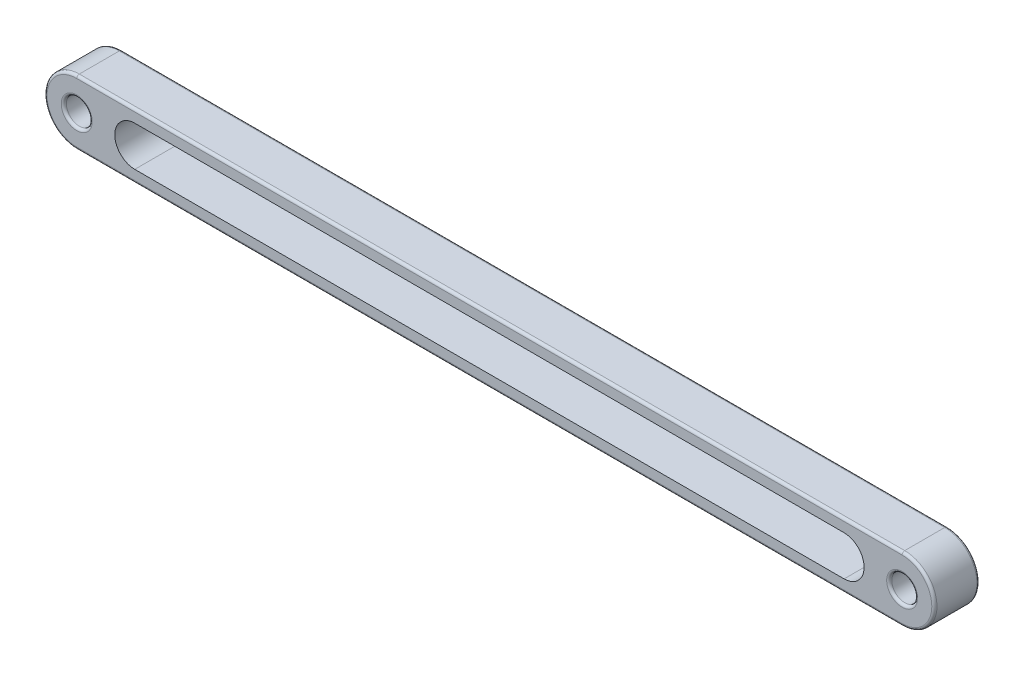
ISO-10303-21;
HEADER;
FILE_DESCRIPTION(('STEP AP214'),'2;1');
FILE_NAME('part.step','',(''),(''),'','','');
FILE_SCHEMA(('AUTOMOTIVE_DESIGN { 1 0 10303 214 1 1 1 1 }'));
ENDSEC;
DATA;
#1=APPLICATION_CONTEXT('core data for automotive mechanical design processes');
#2=APPLICATION_PROTOCOL_DEFINITION('international standard','automotive_design',2000,#1);
#3=PRODUCT_CONTEXT('',#1,'mechanical');
#4=PRODUCT('Part','Part','',(#3));
#5=PRODUCT_RELATED_PRODUCT_CATEGORY('part','',(#4));
#6=PRODUCT_DEFINITION_FORMATION('','',#4);
#7=PRODUCT_DEFINITION_CONTEXT('part definition',#1,'design');
#8=PRODUCT_DEFINITION('design','',#6,#7);
#9=PRODUCT_DEFINITION_SHAPE('','',#8);
#10=(LENGTH_UNIT() NAMED_UNIT(*) SI_UNIT(.MILLI.,.METRE.));
#11=(NAMED_UNIT(*) PLANE_ANGLE_UNIT() SI_UNIT($,.RADIAN.));
#12=(NAMED_UNIT(*) SI_UNIT($,.STERADIAN.) SOLID_ANGLE_UNIT());
#13=UNCERTAINTY_MEASURE_WITH_UNIT(LENGTH_MEASURE(1.E-05),#10,'distance_accuracy_value','');
#14=(GEOMETRIC_REPRESENTATION_CONTEXT(3) GLOBAL_UNCERTAINTY_ASSIGNED_CONTEXT((#13)) GLOBAL_UNIT_ASSIGNED_CONTEXT((#10,
#11,#12)) REPRESENTATION_CONTEXT('',''));
#15=CARTESIAN_POINT('',(0.,0.,0.));
#16=DIRECTION('',(0.,0.,1.));
#17=DIRECTION('',(1.,0.,0.));
#18=AXIS2_PLACEMENT_3D('',#15,#16,#17);
#19=CARTESIAN_POINT('',(-320.,0.,17.5));
#20=DIRECTION('',(0.,0.,-1.));
#21=DIRECTION('',(-1.,0.,0.));
#22=AXIS2_PLACEMENT_3D('',#19,#20,#21);
#23=CYLINDRICAL_SURFACE('',#22,25.);
#24=DIRECTION('',(0.,0.,-1.));
#25=VECTOR('',#24,1.);
#26=CARTESIAN_POINT('',(-320.,-25.,17.5));
#27=LINE('',#26,#25);
#28=CARTESIAN_POINT('',(-320.,-25.,15.5));
#29=VERTEX_POINT('',#28);
#30=CARTESIAN_POINT('',(-320.,-25.,-15.5));
#31=VERTEX_POINT('',#30);
#32=EDGE_CURVE('E177',#29,#31,#27,.T.);
#33=ORIENTED_EDGE('',*,*,#32,.F.);
#34=CARTESIAN_POINT('',(-320.,0.,15.5));
#35=DIRECTION('',(0.,0.,1.));
#36=DIRECTION('',(1.,0.,0.));
#37=AXIS2_PLACEMENT_3D('',#34,#35,#36);
#38=CIRCLE('',#37,25.);
#39=CARTESIAN_POINT('',(-320.,25.,15.5));
#40=VERTEX_POINT('',#39);
#41=EDGE_CURVE('E207',#29,#40,#38,.F.);
#42=ORIENTED_EDGE('',*,*,#41,.T.);
#43=DIRECTION('',(0.,0.,-1.));
#44=VECTOR('',#43,1.);
#45=CARTESIAN_POINT('',(-320.,25.,17.5));
#46=LINE('',#45,#44);
#47=CARTESIAN_POINT('',(-320.,25.,-15.5));
#48=VERTEX_POINT('',#47);
#49=EDGE_CURVE('E168',#40,#48,#46,.T.);
#50=ORIENTED_EDGE('',*,*,#49,.T.);
#51=CARTESIAN_POINT('',(-320.,0.,-15.5));
#52=DIRECTION('',(0.,0.,1.));
#53=DIRECTION('',(1.,0.,0.));
#54=AXIS2_PLACEMENT_3D('',#51,#52,#53);
#55=CIRCLE('',#54,25.);
#56=EDGE_CURVE('E205',#48,#31,#55,.T.);
#57=ORIENTED_EDGE('',*,*,#56,.T.);
#58=EDGE_LOOP('',(#33,#42,#50,#57));
#59=FACE_BOUND('',#58,.T.);
#60=ADVANCED_FACE('F34',(#59),#23,.T.);
#61=CARTESIAN_POINT('',(-320.,-25.,17.5));
#62=DIRECTION('',(0.,1.,0.));
#63=DIRECTION('',(0.,0.,1.));
#64=AXIS2_PLACEMENT_3D('',#61,#62,#63);
#65=PLANE('',#64);
#66=DIRECTION('',(0.,0.,-1.));
#67=VECTOR('',#66,1.);
#68=CARTESIAN_POINT('',(320.,-25.,17.5));
#69=LINE('',#68,#67);
#70=CARTESIAN_POINT('',(320.,-25.,15.5));
#71=VERTEX_POINT('',#70);
#72=CARTESIAN_POINT('',(320.,-25.,-15.5));
#73=VERTEX_POINT('',#72);
#74=EDGE_CURVE('E174',#71,#73,#69,.T.);
#75=ORIENTED_EDGE('',*,*,#74,.F.);
#76=DIRECTION('',(1.,0.,0.));
#77=VECTOR('',#76,1.);
#78=CARTESIAN_POINT('',(-320.,-25.,15.5));
#79=LINE('',#78,#77);
#80=EDGE_CURVE('E203',#71,#29,#79,.F.);
#81=ORIENTED_EDGE('',*,*,#80,.T.);
#82=ORIENTED_EDGE('',*,*,#32,.T.);
#83=DIRECTION('',(1.,0.,0.));
#84=VECTOR('',#83,1.);
#85=CARTESIAN_POINT('',(-320.,-25.,-15.5));
#86=LINE('',#85,#84);
#87=EDGE_CURVE('E201',#31,#73,#86,.T.);
#88=ORIENTED_EDGE('',*,*,#87,.T.);
#89=EDGE_LOOP('',(#75,#81,#82,#88));
#90=FACE_BOUND('',#89,.T.);
#91=ADVANCED_FACE('F284',(#90),#65,.F.);
#92=CARTESIAN_POINT('',(320.,0.,17.5));
#93=DIRECTION('',(0.,0.,-1.));
#94=DIRECTION('',(-1.,0.,0.));
#95=AXIS2_PLACEMENT_3D('',#92,#93,#94);
#96=CYLINDRICAL_SURFACE('',#95,25.);
#97=DIRECTION('',(0.,0.,-1.));
#98=VECTOR('',#97,1.);
#99=CARTESIAN_POINT('',(320.,25.,17.5));
#100=LINE('',#99,#98);
#101=CARTESIAN_POINT('',(320.,25.,15.5));
#102=VERTEX_POINT('',#101);
#103=CARTESIAN_POINT('',(320.,25.,-15.5));
#104=VERTEX_POINT('',#103);
#105=EDGE_CURVE('E171',#102,#104,#100,.T.);
#106=ORIENTED_EDGE('',*,*,#105,.F.);
#107=CARTESIAN_POINT('',(320.,0.,15.5));
#108=DIRECTION('',(0.,0.,1.));
#109=DIRECTION('',(1.,0.,0.));
#110=AXIS2_PLACEMENT_3D('',#107,#108,#109);
#111=CIRCLE('',#110,25.);
#112=EDGE_CURVE('E198',#102,#71,#111,.F.);
#113=ORIENTED_EDGE('',*,*,#112,.T.);
#114=ORIENTED_EDGE('',*,*,#74,.T.);
#115=CARTESIAN_POINT('',(320.,0.,-15.5));
#116=DIRECTION('',(0.,0.,1.));
#117=DIRECTION('',(1.,0.,0.));
#118=AXIS2_PLACEMENT_3D('',#115,#116,#117);
#119=CIRCLE('',#118,25.);
#120=EDGE_CURVE('E195',#73,#104,#119,.T.);
#121=ORIENTED_EDGE('',*,*,#120,.T.);
#122=EDGE_LOOP('',(#106,#113,#114,#121));
#123=FACE_BOUND('',#122,.T.);
#124=ADVANCED_FACE('F268',(#123),#96,.T.);
#125=CARTESIAN_POINT('',(-320.,25.,17.5));
#126=DIRECTION('',(0.,-1.,0.));
#127=DIRECTION('',(0.,0.,-1.));
#128=AXIS2_PLACEMENT_3D('',#125,#126,#127);
#129=PLANE('',#128);
#130=ORIENTED_EDGE('',*,*,#49,.F.);
#131=DIRECTION('',(-1.,0.,0.));
#132=VECTOR('',#131,1.);
#133=CARTESIAN_POINT('',(320.,25.,15.5));
#134=LINE('',#133,#132);
#135=EDGE_CURVE('E224',#40,#102,#134,.F.);
#136=ORIENTED_EDGE('',*,*,#135,.T.);
#137=ORIENTED_EDGE('',*,*,#105,.T.);
#138=DIRECTION('',(-1.,0.,0.));
#139=VECTOR('',#138,1.);
#140=CARTESIAN_POINT('',(-320.,25.,-15.5));
#141=LINE('',#140,#139);
#142=EDGE_CURVE('E222',#104,#48,#141,.T.);
#143=ORIENTED_EDGE('',*,*,#142,.T.);
#144=EDGE_LOOP('',(#130,#136,#137,#143));
#145=FACE_BOUND('',#144,.T.);
#146=ADVANCED_FACE('F271',(#145),#129,.F.);
#147=CARTESIAN_POINT('',(-320.,0.,17.5));
#148=DIRECTION('',(0.,0.,1.));
#149=DIRECTION('',(1.,0.,0.));
#150=AXIS2_PLACEMENT_3D('',#147,#148,#149);
#151=PLANE('',#150);
#152=DIRECTION('',(1.,0.,0.));
#153=VECTOR('',#152,1.);
#154=CARTESIAN_POINT('',(320.,-23.,17.5));
#155=LINE('',#154,#153);
#156=CARTESIAN_POINT('',(-320.,-23.,17.5));
#157=VERTEX_POINT('',#156);
#158=CARTESIAN_POINT('',(320.,-23.,17.5));
#159=VERTEX_POINT('',#158);
#160=EDGE_CURVE('E190',#157,#159,#155,.T.);
#161=ORIENTED_EDGE('',*,*,#160,.T.);
#162=CARTESIAN_POINT('',(320.,0.,17.5));
#163=DIRECTION('',(0.,0.,1.));
#164=DIRECTION('',(1.,0.,0.));
#165=AXIS2_PLACEMENT_3D('',#162,#163,#164);
#166=CIRCLE('',#165,23.);
#167=CARTESIAN_POINT('',(320.,23.,17.5));
#168=VERTEX_POINT('',#167);
#169=EDGE_CURVE('E192',#159,#168,#166,.T.);
#170=ORIENTED_EDGE('',*,*,#169,.T.);
#171=DIRECTION('',(-1.,0.,0.));
#172=VECTOR('',#171,1.);
#173=CARTESIAN_POINT('',(-320.,23.,17.5));
#174=LINE('',#173,#172);
#175=CARTESIAN_POINT('',(-320.,23.,17.5));
#176=VERTEX_POINT('',#175);
#177=EDGE_CURVE('E186',#168,#176,#174,.T.);
#178=ORIENTED_EDGE('',*,*,#177,.T.);
#179=CARTESIAN_POINT('',(-320.,0.,17.5));
#180=DIRECTION('',(0.,0.,1.));
#181=DIRECTION('',(1.,0.,0.));
#182=AXIS2_PLACEMENT_3D('',#179,#180,#181);
#183=CIRCLE('',#182,23.);
#184=EDGE_CURVE('E188',#176,#157,#183,.T.);
#185=ORIENTED_EDGE('',*,*,#184,.T.);
#186=EDGE_LOOP('',(#161,#170,#178,#185));
#187=FACE_BOUND('',#186,.T.);
#188=CARTESIAN_POINT('',(320.,0.,17.5));
#189=DIRECTION('',(0.,0.,1.));
#190=DIRECTION('',(1.,0.,0.));
#191=AXIS2_PLACEMENT_3D('',#188,#189,#190);
#192=CIRCLE('',#191,12.);
#193=CARTESIAN_POINT('',(332.,0.,17.5));
#194=VERTEX_POINT('',#193);
#195=EDGE_CURVE('E183',#194,#194,#192,.F.);
#196=ORIENTED_EDGE('',*,*,#195,.T.);
#197=EDGE_LOOP('',(#196));
#198=FACE_BOUND('',#197,.T.);
#199=CARTESIAN_POINT('',(-320.,0.,17.5));
#200=DIRECTION('',(0.,0.,1.));
#201=DIRECTION('',(1.,0.,0.));
#202=AXIS2_PLACEMENT_3D('',#199,#200,#201);
#203=CIRCLE('',#202,12.);
#204=CARTESIAN_POINT('',(-308.,0.,17.5));
#205=VERTEX_POINT('',#204);
#206=EDGE_CURVE('E180',#205,#205,#203,.F.);
#207=ORIENTED_EDGE('',*,*,#206,.T.);
#208=EDGE_LOOP('',(#207));
#209=FACE_BOUND('',#208,.T.);
#210=CARTESIAN_POINT('',(275.,0.,17.5));
#211=DIRECTION('',(0.,0.,1.));
#212=DIRECTION('',(1.,0.,0.));
#213=AXIS2_PLACEMENT_3D('',#210,#211,#212);
#214=CIRCLE('',#213,15.5);
#215=CARTESIAN_POINT('',(275.,-15.5,17.5));
#216=VERTEX_POINT('',#215);
#217=CARTESIAN_POINT('',(275.,15.5,17.5));
#218=VERTEX_POINT('',#217);
#219=EDGE_CURVE('E166',#216,#218,#214,.T.);
#220=ORIENTED_EDGE('',*,*,#219,.F.);
#221=DIRECTION('',(1.,0.,0.));
#222=VECTOR('',#221,1.);
#223=CARTESIAN_POINT('',(-320.,-15.5,17.5));
#224=LINE('',#223,#222);
#225=CARTESIAN_POINT('',(-275.,-15.5,17.5));
#226=VERTEX_POINT('',#225);
#227=EDGE_CURVE('E159',#226,#216,#224,.T.);
#228=ORIENTED_EDGE('',*,*,#227,.F.);
#229=CARTESIAN_POINT('',(-275.,0.,17.5));
#230=DIRECTION('',(0.,0.,1.));
#231=DIRECTION('',(1.,0.,0.));
#232=AXIS2_PLACEMENT_3D('',#229,#230,#231);
#233=CIRCLE('',#232,15.5);
#234=CARTESIAN_POINT('',(-275.,15.5,17.5));
#235=VERTEX_POINT('',#234);
#236=EDGE_CURVE('E135',#235,#226,#233,.T.);
#237=ORIENTED_EDGE('',*,*,#236,.F.);
#238=DIRECTION('',(-1.,0.,0.));
#239=VECTOR('',#238,1.);
#240=CARTESIAN_POINT('',(-320.,15.5,17.5));
#241=LINE('',#240,#239);
#242=EDGE_CURVE('E164',#218,#235,#241,.T.);
#243=ORIENTED_EDGE('',*,*,#242,.F.);
#244=EDGE_LOOP('',(#220,#228,#237,#243));
#245=FACE_BOUND('',#244,.T.);
#246=ADVANCED_FACE('F296',(#187,#198,#209,#245),#151,.T.);
#247=CARTESIAN_POINT('',(-320.,0.,-17.5));
#248=DIRECTION('',(0.,0.,1.));
#249=DIRECTION('',(1.,0.,0.));
#250=AXIS2_PLACEMENT_3D('',#247,#248,#249);
#251=PLANE('',#250);
#252=DIRECTION('',(-1.,0.,0.));
#253=VECTOR('',#252,1.);
#254=CARTESIAN_POINT('',(-320.,23.,-17.5));
#255=LINE('',#254,#253);
#256=CARTESIAN_POINT('',(-320.,23.,-17.5));
#257=VERTEX_POINT('',#256);
#258=CARTESIAN_POINT('',(320.,23.,-17.5));
#259=VERTEX_POINT('',#258);
#260=EDGE_CURVE('E215',#257,#259,#255,.F.);
#261=ORIENTED_EDGE('',*,*,#260,.T.);
#262=CARTESIAN_POINT('',(320.,0.,-17.5));
#263=DIRECTION('',(0.,0.,1.));
#264=DIRECTION('',(1.,0.,0.));
#265=AXIS2_PLACEMENT_3D('',#262,#263,#264);
#266=CIRCLE('',#265,23.);
#267=CARTESIAN_POINT('',(320.,-23.,-17.5));
#268=VERTEX_POINT('',#267);
#269=EDGE_CURVE('E220',#259,#268,#266,.F.);
#270=ORIENTED_EDGE('',*,*,#269,.T.);
#271=DIRECTION('',(1.,0.,0.));
#272=VECTOR('',#271,1.);
#273=CARTESIAN_POINT('',(-320.,-23.,-17.5));
#274=LINE('',#273,#272);
#275=CARTESIAN_POINT('',(-320.,-23.,-17.5));
#276=VERTEX_POINT('',#275);
#277=EDGE_CURVE('E58',#268,#276,#274,.F.);
#278=ORIENTED_EDGE('',*,*,#277,.T.);
#279=CARTESIAN_POINT('',(-320.,0.,-17.5));
#280=DIRECTION('',(0.,0.,1.));
#281=DIRECTION('',(1.,0.,0.));
#282=AXIS2_PLACEMENT_3D('',#279,#280,#281);
#283=CIRCLE('',#282,23.);
#284=EDGE_CURVE('E217',#276,#257,#283,.F.);
#285=ORIENTED_EDGE('',*,*,#284,.T.);
#286=EDGE_LOOP('',(#261,#270,#278,#285));
#287=FACE_BOUND('',#286,.T.);
#288=CARTESIAN_POINT('',(320.,0.,-17.5));
#289=DIRECTION('',(0.,0.,1.));
#290=DIRECTION('',(1.,0.,0.));
#291=AXIS2_PLACEMENT_3D('',#288,#289,#290);
#292=CIRCLE('',#291,12.);
#293=CARTESIAN_POINT('',(332.,0.,-17.5));
#294=VERTEX_POINT('',#293);
#295=EDGE_CURVE('E212',#294,#294,#292,.T.);
#296=ORIENTED_EDGE('',*,*,#295,.T.);
#297=EDGE_LOOP('',(#296));
#298=FACE_BOUND('',#297,.T.);
#299=CARTESIAN_POINT('',(-320.,0.,-17.5));
#300=DIRECTION('',(0.,0.,1.));
#301=DIRECTION('',(1.,0.,0.));
#302=AXIS2_PLACEMENT_3D('',#299,#300,#301);
#303=CIRCLE('',#302,12.);
#304=CARTESIAN_POINT('',(-308.,0.,-17.5));
#305=VERTEX_POINT('',#304);
#306=EDGE_CURVE('E209',#305,#305,#303,.T.);
#307=ORIENTED_EDGE('',*,*,#306,.T.);
#308=EDGE_LOOP('',(#307));
#309=FACE_BOUND('',#308,.T.);
#310=DIRECTION('',(-1.,0.,0.));
#311=VECTOR('',#310,1.);
#312=CARTESIAN_POINT('',(275.,-15.5,-17.5));
#313=LINE('',#312,#311);
#314=CARTESIAN_POINT('',(275.,-15.5,-17.5));
#315=VERTEX_POINT('',#314);
#316=CARTESIAN_POINT('',(-275.,-15.5,-17.5));
#317=VERTEX_POINT('',#316);
#318=EDGE_CURVE('E143',#315,#317,#313,.T.);
#319=ORIENTED_EDGE('',*,*,#318,.F.);
#320=CARTESIAN_POINT('',(275.,0.,-17.5));
#321=DIRECTION('',(0.,0.,-1.));
#322=DIRECTION('',(-1.,0.,0.));
#323=AXIS2_PLACEMENT_3D('',#320,#321,#322);
#324=CIRCLE('',#323,15.5);
#325=CARTESIAN_POINT('',(275.,15.5,-17.5));
#326=VERTEX_POINT('',#325);
#327=EDGE_CURVE('E148',#326,#315,#324,.T.);
#328=ORIENTED_EDGE('',*,*,#327,.F.);
#329=DIRECTION('',(1.,0.,0.));
#330=VECTOR('',#329,1.);
#331=CARTESIAN_POINT('',(275.,15.5,-17.5));
#332=LINE('',#331,#330);
#333=CARTESIAN_POINT('',(-275.,15.5,-17.5));
#334=VERTEX_POINT('',#333);
#335=EDGE_CURVE('E152',#334,#326,#332,.T.);
#336=ORIENTED_EDGE('',*,*,#335,.F.);
#337=CARTESIAN_POINT('',(-275.,0.,-17.5));
#338=DIRECTION('',(0.,0.,-1.));
#339=DIRECTION('',(-1.,0.,0.));
#340=AXIS2_PLACEMENT_3D('',#337,#338,#339);
#341=CIRCLE('',#340,15.5);
#342=EDGE_CURVE('E132',#317,#334,#341,.T.);
#343=ORIENTED_EDGE('',*,*,#342,.F.);
#344=EDGE_LOOP('',(#319,#328,#336,#343));
#345=FACE_BOUND('',#344,.T.);
#346=ADVANCED_FACE('F150',(#287,#298,#309,#345),#251,.F.);
#347=CARTESIAN_POINT('',(-320.,0.,-17.5));
#348=DIRECTION('',(0.,0.,1.));
#349=DIRECTION('',(1.,0.,0.));
#350=AXIS2_PLACEMENT_3D('',#347,#348,#349);
#351=CYLINDRICAL_SURFACE('',#350,10.);
#352=CARTESIAN_POINT('',(-320.,0.,15.5));
#353=DIRECTION('',(0.,0.,1.));
#354=DIRECTION('',(1.,0.,0.));
#355=AXIS2_PLACEMENT_3D('',#352,#353,#354);
#356=CIRCLE('',#355,10.);
#357=CARTESIAN_POINT('',(-310.,0.,15.5));
#358=VERTEX_POINT('',#357);
#359=EDGE_CURVE('E11',#358,#358,#356,.T.);
#360=ORIENTED_EDGE('',*,*,#359,.T.);
#361=EDGE_LOOP('',(#360));
#362=FACE_BOUND('',#361,.T.);
#363=CARTESIAN_POINT('',(-320.,0.,-15.5));
#364=DIRECTION('',(0.,0.,1.));
#365=DIRECTION('',(1.,0.,0.));
#366=AXIS2_PLACEMENT_3D('',#363,#364,#365);
#367=CIRCLE('',#366,10.);
#368=CARTESIAN_POINT('',(-310.,0.,-15.5));
#369=VERTEX_POINT('',#368);
#370=EDGE_CURVE('E43',#369,#369,#367,.F.);
#371=ORIENTED_EDGE('',*,*,#370,.T.);
#372=EDGE_LOOP('',(#371));
#373=FACE_BOUND('',#372,.T.);
#374=ADVANCED_FACE('F361',(#362,#373),#351,.F.);
#375=CARTESIAN_POINT('',(320.,0.,-17.5));
#376=DIRECTION('',(0.,0.,1.));
#377=DIRECTION('',(1.,0.,0.));
#378=AXIS2_PLACEMENT_3D('',#375,#376,#377);
#379=CYLINDRICAL_SURFACE('',#378,10.);
#380=CARTESIAN_POINT('',(320.,0.,15.5));
#381=DIRECTION('',(0.,0.,1.));
#382=DIRECTION('',(1.,0.,0.));
#383=AXIS2_PLACEMENT_3D('',#380,#381,#382);
#384=CIRCLE('',#383,10.);
#385=CARTESIAN_POINT('',(330.,0.,15.5));
#386=VERTEX_POINT('',#385);
#387=EDGE_CURVE('E229',#386,#386,#384,.T.);
#388=ORIENTED_EDGE('',*,*,#387,.T.);
#389=EDGE_LOOP('',(#388));
#390=FACE_BOUND('',#389,.T.);
#391=CARTESIAN_POINT('',(320.,0.,-15.5));
#392=DIRECTION('',(0.,0.,1.));
#393=DIRECTION('',(1.,0.,0.));
#394=AXIS2_PLACEMENT_3D('',#391,#392,#393);
#395=CIRCLE('',#394,10.);
#396=CARTESIAN_POINT('',(330.,0.,-15.5));
#397=VERTEX_POINT('',#396);
#398=EDGE_CURVE('E226',#397,#397,#395,.F.);
#399=ORIENTED_EDGE('',*,*,#398,.T.);
#400=EDGE_LOOP('',(#399));
#401=FACE_BOUND('',#400,.T.);
#402=ADVANCED_FACE('F318',(#390,#401),#379,.F.);
#403=CARTESIAN_POINT('',(275.,0.,22.5));
#404=DIRECTION('',(0.,0.,-1.));
#405=DIRECTION('',(-1.,0.,0.));
#406=AXIS2_PLACEMENT_3D('',#403,#404,#405);
#407=CYLINDRICAL_SURFACE('',#406,15.5);
#408=ORIENTED_EDGE('',*,*,#219,.T.);
#409=DIRECTION('',(0.,0.,-1.));
#410=VECTOR('',#409,1.);
#411=CARTESIAN_POINT('',(275.,15.5,22.5));
#412=LINE('',#411,#410);
#413=EDGE_CURVE('E157',#218,#326,#412,.T.);
#414=ORIENTED_EDGE('',*,*,#413,.T.);
#415=ORIENTED_EDGE('',*,*,#327,.T.);
#416=DIRECTION('',(0.,0.,-1.));
#417=VECTOR('',#416,1.);
#418=CARTESIAN_POINT('',(275.,-15.5,22.5));
#419=LINE('',#418,#417);
#420=EDGE_CURVE('E139',#216,#315,#419,.T.);
#421=ORIENTED_EDGE('',*,*,#420,.F.);
#422=EDGE_LOOP('',(#408,#414,#415,#421));
#423=FACE_BOUND('',#422,.T.);
#424=ADVANCED_FACE('F308',(#423),#407,.F.);
#425=CARTESIAN_POINT('',(275.,15.5,22.5));
#426=DIRECTION('',(0.,1.,0.));
#427=DIRECTION('',(0.,0.,1.));
#428=AXIS2_PLACEMENT_3D('',#425,#426,#427);
#429=PLANE('',#428);
#430=ORIENTED_EDGE('',*,*,#242,.T.);
#431=DIRECTION('',(0.,0.,-1.));
#432=VECTOR('',#431,1.);
#433=CARTESIAN_POINT('',(-275.,15.5,22.5));
#434=LINE('',#433,#432);
#435=EDGE_CURVE('E138',#235,#334,#434,.T.);
#436=ORIENTED_EDGE('',*,*,#435,.T.);
#437=ORIENTED_EDGE('',*,*,#335,.T.);
#438=ORIENTED_EDGE('',*,*,#413,.F.);
#439=EDGE_LOOP('',(#430,#436,#437,#438));
#440=FACE_BOUND('',#439,.T.);
#441=ADVANCED_FACE('F310',(#440),#429,.F.);
#442=CARTESIAN_POINT('',(-275.,0.,22.5));
#443=DIRECTION('',(0.,0.,-1.));
#444=DIRECTION('',(-1.,0.,0.));
#445=AXIS2_PLACEMENT_3D('',#442,#443,#444);
#446=CYLINDRICAL_SURFACE('',#445,15.5);
#447=ORIENTED_EDGE('',*,*,#236,.T.);
#448=DIRECTION('',(0.,0.,-1.));
#449=VECTOR('',#448,1.);
#450=CARTESIAN_POINT('',(-275.,-15.5,22.5));
#451=LINE('',#450,#449);
#452=EDGE_CURVE('E127',#226,#317,#451,.T.);
#453=ORIENTED_EDGE('',*,*,#452,.T.);
#454=ORIENTED_EDGE('',*,*,#342,.T.);
#455=ORIENTED_EDGE('',*,*,#435,.F.);
#456=EDGE_LOOP('',(#447,#453,#454,#455));
#457=FACE_BOUND('',#456,.T.);
#458=ADVANCED_FACE('F129',(#457),#446,.F.);
#459=CARTESIAN_POINT('',(275.,-15.5,22.5));
#460=DIRECTION('',(0.,-1.,0.));
#461=DIRECTION('',(0.,0.,-1.));
#462=AXIS2_PLACEMENT_3D('',#459,#460,#461);
#463=PLANE('',#462);
#464=ORIENTED_EDGE('',*,*,#227,.T.);
#465=ORIENTED_EDGE('',*,*,#420,.T.);
#466=ORIENTED_EDGE('',*,*,#318,.T.);
#467=ORIENTED_EDGE('',*,*,#452,.F.);
#468=EDGE_LOOP('',(#464,#465,#466,#467));
#469=FACE_BOUND('',#468,.T.);
#470=ADVANCED_FACE('F144',(#469),#463,.F.);
#471=CARTESIAN_POINT('',(-320.,0.,15.5));
#472=DIRECTION('',(0.,0.,1.));
#473=DIRECTION('',(1.,0.,0.));
#474=AXIS2_PLACEMENT_3D('',#471,#472,#473);
#475=TOROIDAL_SURFACE('',#474,23.,2.);
#476=CARTESIAN_POINT('',(-320.,23.,15.5));
#477=DIRECTION('',(1.,0.,0.));
#478=DIRECTION('',(0.,0.,-1.));
#479=AXIS2_PLACEMENT_3D('',#476,#477,#478);
#480=CIRCLE('',#479,2.);
#481=EDGE_CURVE('E238',#40,#176,#480,.T.);
#482=ORIENTED_EDGE('',*,*,#481,.F.);
#483=ORIENTED_EDGE('',*,*,#41,.F.);
#484=CARTESIAN_POINT('',(-320.,-23.,15.5));
#485=DIRECTION('',(1.,0.,0.));
#486=DIRECTION('',(0.,0.,-1.));
#487=AXIS2_PLACEMENT_3D('',#484,#485,#486);
#488=CIRCLE('',#487,2.);
#489=EDGE_CURVE('E241',#157,#29,#488,.T.);
#490=ORIENTED_EDGE('',*,*,#489,.F.);
#491=ORIENTED_EDGE('',*,*,#184,.F.);
#492=EDGE_LOOP('',(#482,#483,#490,#491));
#493=FACE_BOUND('',#492,.T.);
#494=ADVANCED_FACE('F290',(#493),#475,.T.);
#495=CARTESIAN_POINT('',(-320.,-23.,15.5));
#496=DIRECTION('',(-1.,0.,0.));
#497=DIRECTION('',(0.,0.,1.));
#498=AXIS2_PLACEMENT_3D('',#495,#496,#497);
#499=CYLINDRICAL_SURFACE('',#498,2.);
#500=ORIENTED_EDGE('',*,*,#489,.T.);
#501=ORIENTED_EDGE('',*,*,#80,.F.);
#502=CARTESIAN_POINT('',(320.,-23.,15.5));
#503=DIRECTION('',(1.,0.,0.));
#504=DIRECTION('',(0.,0.,-1.));
#505=AXIS2_PLACEMENT_3D('',#502,#503,#504);
#506=CIRCLE('',#505,2.);
#507=EDGE_CURVE('E236',#159,#71,#506,.T.);
#508=ORIENTED_EDGE('',*,*,#507,.F.);
#509=ORIENTED_EDGE('',*,*,#160,.F.);
#510=EDGE_LOOP('',(#500,#501,#508,#509));
#511=FACE_BOUND('',#510,.T.);
#512=ADVANCED_FACE('F294',(#511),#499,.T.);
#513=CARTESIAN_POINT('',(-320.,23.,15.5));
#514=DIRECTION('',(1.,0.,0.));
#515=DIRECTION('',(0.,0.,-1.));
#516=AXIS2_PLACEMENT_3D('',#513,#514,#515);
#517=CYLINDRICAL_SURFACE('',#516,2.);
#518=ORIENTED_EDGE('',*,*,#481,.T.);
#519=ORIENTED_EDGE('',*,*,#177,.F.);
#520=CARTESIAN_POINT('',(320.,23.,15.5));
#521=DIRECTION('',(1.,0.,0.));
#522=DIRECTION('',(0.,0.,-1.));
#523=AXIS2_PLACEMENT_3D('',#520,#521,#522);
#524=CIRCLE('',#523,2.);
#525=EDGE_CURVE('E234',#102,#168,#524,.T.);
#526=ORIENTED_EDGE('',*,*,#525,.F.);
#527=ORIENTED_EDGE('',*,*,#135,.F.);
#528=EDGE_LOOP('',(#518,#519,#526,#527));
#529=FACE_BOUND('',#528,.T.);
#530=ADVANCED_FACE('F276',(#529),#517,.T.);
#531=CARTESIAN_POINT('',(320.,0.,15.5));
#532=DIRECTION('',(0.,0.,1.));
#533=DIRECTION('',(1.,0.,0.));
#534=AXIS2_PLACEMENT_3D('',#531,#532,#533);
#535=TOROIDAL_SURFACE('',#534,23.,2.);
#536=ORIENTED_EDGE('',*,*,#507,.T.);
#537=ORIENTED_EDGE('',*,*,#112,.F.);
#538=ORIENTED_EDGE('',*,*,#525,.T.);
#539=ORIENTED_EDGE('',*,*,#169,.F.);
#540=EDGE_LOOP('',(#536,#537,#538,#539));
#541=FACE_BOUND('',#540,.T.);
#542=ADVANCED_FACE('F280',(#541),#535,.T.);
#543=CARTESIAN_POINT('',(-320.,0.,-15.5));
#544=DIRECTION('',(0.,0.,1.));
#545=DIRECTION('',(1.,0.,0.));
#546=AXIS2_PLACEMENT_3D('',#543,#544,#545);
#547=TOROIDAL_SURFACE('',#546,23.,2.);
#548=CARTESIAN_POINT('',(-320.,23.,-15.5));
#549=DIRECTION('',(1.,0.,0.));
#550=DIRECTION('',(0.,0.,-1.));
#551=AXIS2_PLACEMENT_3D('',#548,#549,#550);
#552=CIRCLE('',#551,2.);
#553=EDGE_CURVE('E246',#257,#48,#552,.T.);
#554=ORIENTED_EDGE('',*,*,#553,.F.);
#555=ORIENTED_EDGE('',*,*,#284,.F.);
#556=CARTESIAN_POINT('',(-320.,-23.,-15.5));
#557=DIRECTION('',(1.,0.,0.));
#558=DIRECTION('',(0.,0.,-1.));
#559=AXIS2_PLACEMENT_3D('',#556,#557,#558);
#560=CIRCLE('',#559,2.);
#561=EDGE_CURVE('E38',#31,#276,#560,.T.);
#562=ORIENTED_EDGE('',*,*,#561,.F.);
#563=ORIENTED_EDGE('',*,*,#56,.F.);
#564=EDGE_LOOP('',(#554,#555,#562,#563));
#565=FACE_BOUND('',#564,.T.);
#566=ADVANCED_FACE('F259',(#565),#547,.T.);
#567=CARTESIAN_POINT('',(-320.,-23.,-15.5));
#568=DIRECTION('',(1.,0.,0.));
#569=DIRECTION('',(0.,0.,-1.));
#570=AXIS2_PLACEMENT_3D('',#567,#568,#569);
#571=CYLINDRICAL_SURFACE('',#570,2.);
#572=ORIENTED_EDGE('',*,*,#561,.T.);
#573=ORIENTED_EDGE('',*,*,#277,.F.);
#574=CARTESIAN_POINT('',(320.,-23.,-15.5));
#575=DIRECTION('',(1.,0.,0.));
#576=DIRECTION('',(0.,0.,-1.));
#577=AXIS2_PLACEMENT_3D('',#574,#575,#576);
#578=CIRCLE('',#577,2.);
#579=EDGE_CURVE('E51',#73,#268,#578,.T.);
#580=ORIENTED_EDGE('',*,*,#579,.F.);
#581=ORIENTED_EDGE('',*,*,#87,.F.);
#582=EDGE_LOOP('',(#572,#573,#580,#581));
#583=FACE_BOUND('',#582,.T.);
#584=ADVANCED_FACE('F256',(#583),#571,.T.);
#585=CARTESIAN_POINT('',(-320.,23.,-15.5));
#586=DIRECTION('',(-1.,0.,0.));
#587=DIRECTION('',(0.,0.,1.));
#588=AXIS2_PLACEMENT_3D('',#585,#586,#587);
#589=CYLINDRICAL_SURFACE('',#588,2.);
#590=ORIENTED_EDGE('',*,*,#553,.T.);
#591=ORIENTED_EDGE('',*,*,#142,.F.);
#592=CARTESIAN_POINT('',(320.,23.,-15.5));
#593=DIRECTION('',(1.,0.,0.));
#594=DIRECTION('',(0.,0.,-1.));
#595=AXIS2_PLACEMENT_3D('',#592,#593,#594);
#596=CIRCLE('',#595,2.);
#597=EDGE_CURVE('E244',#259,#104,#596,.T.);
#598=ORIENTED_EDGE('',*,*,#597,.F.);
#599=ORIENTED_EDGE('',*,*,#260,.F.);
#600=EDGE_LOOP('',(#590,#591,#598,#599));
#601=FACE_BOUND('',#600,.T.);
#602=ADVANCED_FACE('F263',(#601),#589,.T.);
#603=CARTESIAN_POINT('',(320.,0.,-15.5));
#604=DIRECTION('',(0.,0.,1.));
#605=DIRECTION('',(1.,0.,0.));
#606=AXIS2_PLACEMENT_3D('',#603,#604,#605);
#607=TOROIDAL_SURFACE('',#606,23.,2.);
#608=ORIENTED_EDGE('',*,*,#579,.T.);
#609=ORIENTED_EDGE('',*,*,#269,.F.);
#610=ORIENTED_EDGE('',*,*,#597,.T.);
#611=ORIENTED_EDGE('',*,*,#120,.F.);
#612=EDGE_LOOP('',(#608,#609,#610,#611));
#613=FACE_BOUND('',#612,.T.);
#614=ADVANCED_FACE('F262',(#613),#607,.T.);
#615=CARTESIAN_POINT('',(320.,0.,15.5));
#616=DIRECTION('',(0.,0.,1.));
#617=DIRECTION('',(1.,0.,0.));
#618=AXIS2_PLACEMENT_3D('',#615,#616,#617);
#619=TOROIDAL_SURFACE('',#618,12.,2.);
#620=ORIENTED_EDGE('',*,*,#195,.F.);
#621=EDGE_LOOP('',(#620));
#622=FACE_BOUND('',#621,.T.);
#623=ORIENTED_EDGE('',*,*,#387,.F.);
#624=EDGE_LOOP('',(#623));
#625=FACE_BOUND('',#624,.T.);
#626=ADVANCED_FACE('F338',(#622,#625),#619,.T.);
#627=CARTESIAN_POINT('',(320.,0.,-15.5));
#628=DIRECTION('',(0.,0.,1.));
#629=DIRECTION('',(1.,0.,0.));
#630=AXIS2_PLACEMENT_3D('',#627,#628,#629);
#631=TOROIDAL_SURFACE('',#630,12.,2.);
#632=ORIENTED_EDGE('',*,*,#398,.F.);
#633=EDGE_LOOP('',(#632));
#634=FACE_BOUND('',#633,.T.);
#635=ORIENTED_EDGE('',*,*,#295,.F.);
#636=EDGE_LOOP('',(#635));
#637=FACE_BOUND('',#636,.T.);
#638=ADVANCED_FACE('F347',(#634,#637),#631,.T.);
#639=CARTESIAN_POINT('',(-320.,0.,15.5));
#640=DIRECTION('',(0.,0.,1.));
#641=DIRECTION('',(1.,0.,0.));
#642=AXIS2_PLACEMENT_3D('',#639,#640,#641);
#643=TOROIDAL_SURFACE('',#642,12.,2.);
#644=ORIENTED_EDGE('',*,*,#206,.F.);
#645=EDGE_LOOP('',(#644));
#646=FACE_BOUND('',#645,.T.);
#647=ORIENTED_EDGE('',*,*,#359,.F.);
#648=EDGE_LOOP('',(#647));
#649=FACE_BOUND('',#648,.T.);
#650=ADVANCED_FACE('F350',(#646,#649),#643,.T.);
#651=CARTESIAN_POINT('',(-320.,0.,-15.5));
#652=DIRECTION('',(0.,0.,1.));
#653=DIRECTION('',(1.,0.,0.));
#654=AXIS2_PLACEMENT_3D('',#651,#652,#653);
#655=TOROIDAL_SURFACE('',#654,12.,2.);
#656=ORIENTED_EDGE('',*,*,#370,.F.);
#657=EDGE_LOOP('',(#656));
#658=FACE_BOUND('',#657,.T.);
#659=ORIENTED_EDGE('',*,*,#306,.F.);
#660=EDGE_LOOP('',(#659));
#661=FACE_BOUND('',#660,.T.);
#662=ADVANCED_FACE('F36',(#658,#661),#655,.T.);
#663=CLOSED_SHELL('',(#60,#91,#124,#146,#246,#346,#374,#402,#424,#441,#458,#470,#494,#512,#530,
#542,#566,#584,#602,#614,#626,#638,#650,#662));
#664=MANIFOLD_SOLID_BREP('B2',#663);
#665=ADVANCED_BREP_SHAPE_REPRESENTATION('',(#18,#664),#14);
#666=SHAPE_DEFINITION_REPRESENTATION(#9,#665);
ENDSEC;
END-ISO-10303-21;
